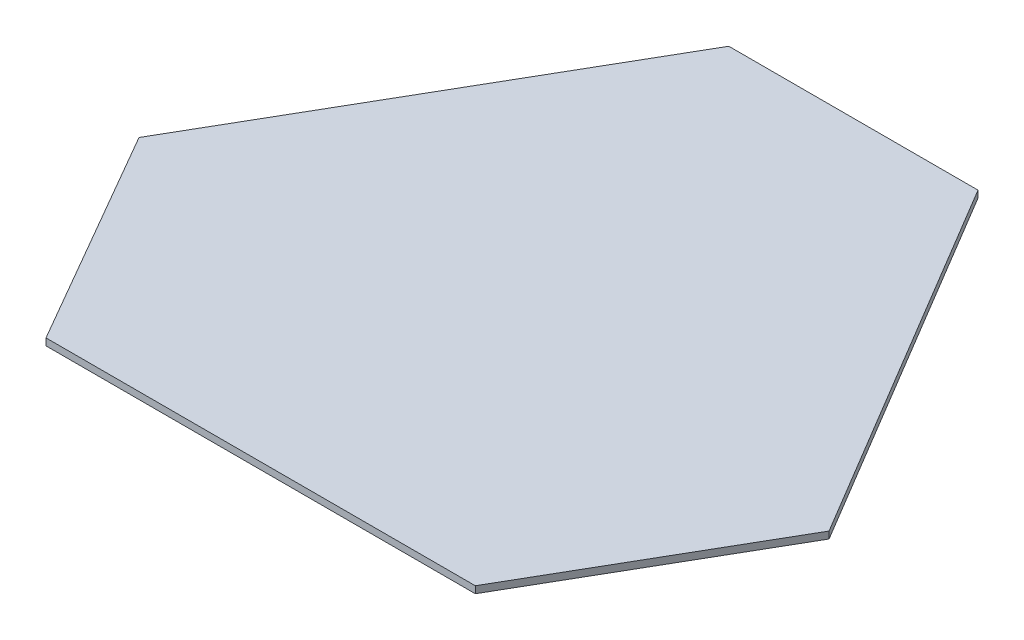
ISO-10303-21;
HEADER;
FILE_DESCRIPTION(('STEP AP214'),'2;1');
FILE_NAME('part.step','',(''),(''),'','','');
FILE_SCHEMA(('AUTOMOTIVE_DESIGN { 1 0 10303 214 1 1 1 1 }'));
ENDSEC;
DATA;
#1=APPLICATION_CONTEXT('core data for automotive mechanical design processes');
#2=APPLICATION_PROTOCOL_DEFINITION('international standard','automotive_design',2000,#1);
#3=PRODUCT_CONTEXT('',#1,'mechanical');
#4=PRODUCT('Part','Part','',(#3));
#5=PRODUCT_RELATED_PRODUCT_CATEGORY('part','',(#4));
#6=PRODUCT_DEFINITION_FORMATION('','',#4);
#7=PRODUCT_DEFINITION_CONTEXT('part definition',#1,'design');
#8=PRODUCT_DEFINITION('design','',#6,#7);
#9=PRODUCT_DEFINITION_SHAPE('','',#8);
#10=(LENGTH_UNIT() NAMED_UNIT(*) SI_UNIT(.MILLI.,.METRE.));
#11=(NAMED_UNIT(*) PLANE_ANGLE_UNIT() SI_UNIT($,.RADIAN.));
#12=(NAMED_UNIT(*) SI_UNIT($,.STERADIAN.) SOLID_ANGLE_UNIT());
#13=UNCERTAINTY_MEASURE_WITH_UNIT(LENGTH_MEASURE(1.E-05),#10,'distance_accuracy_value','');
#14=(GEOMETRIC_REPRESENTATION_CONTEXT(3) GLOBAL_UNCERTAINTY_ASSIGNED_CONTEXT((#13)) GLOBAL_UNIT_ASSIGNED_CONTEXT((#10,
#11,#12)) REPRESENTATION_CONTEXT('',''));
#15=CARTESIAN_POINT('',(0.,0.,0.));
#16=DIRECTION('',(0.,0.,1.));
#17=DIRECTION('',(1.,0.,0.));
#18=AXIS2_PLACEMENT_3D('',#15,#16,#17);
#19=CARTESIAN_POINT('',(-150.023446497774,3.,54.8587623398593));
#20=DIRECTION('',(0.866025403784419,0.,0.500000000000034));
#21=DIRECTION('',(0.500000000000034,0.,-0.866025403784419));
#22=AXIS2_PLACEMENT_3D('',#19,#20,#21);
#23=PLANE('',#22);
#24=DIRECTION('',(-0.500000000000034,0.,0.866025403784419));
#25=VECTOR('',#24,1.);
#26=CARTESIAN_POINT('',(-150.023446497774,0.,54.8587623398593));
#27=LINE('',#26,#25);
#28=CARTESIAN_POINT('',(-56.6816904909937,0.,-106.813901531567));
#29=VERTEX_POINT('',#28);
#30=CARTESIAN_POINT('',(-150.023446497774,0.,54.8587623398593));
#31=VERTEX_POINT('',#30);
#32=EDGE_CURVE('E121',#29,#31,#27,.T.);
#33=ORIENTED_EDGE('',*,*,#32,.T.);
#34=DIRECTION('',(0.,-1.,0.));
#35=VECTOR('',#34,1.);
#36=CARTESIAN_POINT('',(-150.023446497774,3.,54.8587623398593));
#37=LINE('',#36,#35);
#38=CARTESIAN_POINT('',(-150.023446497774,3.,54.8587623398593));
#39=VERTEX_POINT('',#38);
#40=EDGE_CURVE('E11',#39,#31,#37,.T.);
#41=ORIENTED_EDGE('',*,*,#40,.F.);
#42=DIRECTION('',(-0.500000000000034,0.,0.866025403784419));
#43=VECTOR('',#42,1.);
#44=CARTESIAN_POINT('',(-150.023446497774,3.,54.8587623398593));
#45=LINE('',#44,#43);
#46=CARTESIAN_POINT('',(-56.6816904909937,3.,-106.813901531567));
#47=VERTEX_POINT('',#46);
#48=EDGE_CURVE('E131',#47,#39,#45,.T.);
#49=ORIENTED_EDGE('',*,*,#48,.F.);
#50=DIRECTION('',(0.,-1.,0.));
#51=VECTOR('',#50,1.);
#52=CARTESIAN_POINT('',(-56.6816904909937,3.,-106.813901531567));
#53=LINE('',#52,#51);
#54=EDGE_CURVE('E117',#47,#29,#53,.T.);
#55=ORIENTED_EDGE('',*,*,#54,.T.);
#56=EDGE_LOOP('',(#33,#41,#49,#55));
#57=FACE_BOUND('',#56,.T.);
#58=ADVANCED_FACE('F37',(#57),#23,.F.);
#59=CARTESIAN_POINT('',(-150.023446497774,3.,54.8587623398593));
#60=DIRECTION('',(0.866025403784436,0.,-0.500000000000004));
#61=DIRECTION('',(-0.500000000000004,0.,-0.866025403784436));
#62=AXIS2_PLACEMENT_3D('',#59,#60,#61);
#63=PLANE('',#62);
#64=DIRECTION('',(0.500000000000004,0.,0.866025403784436));
#65=VECTOR('',#64,1.);
#66=CARTESIAN_POINT('',(-150.023446497774,0.,54.8587623398593));
#67=LINE('',#66,#65);
#68=CARTESIAN_POINT('',(-95.093627323657,0.,150.));
#69=VERTEX_POINT('',#68);
#70=EDGE_CURVE('E124',#31,#69,#67,.T.);
#71=ORIENTED_EDGE('',*,*,#70,.T.);
#72=DIRECTION('',(0.,-1.,0.));
#73=VECTOR('',#72,1.);
#74=CARTESIAN_POINT('',(-95.093627323657,3.,150.));
#75=LINE('',#74,#73);
#76=CARTESIAN_POINT('',(-95.093627323657,3.,150.));
#77=VERTEX_POINT('',#76);
#78=EDGE_CURVE('E45',#77,#69,#75,.T.);
#79=ORIENTED_EDGE('',*,*,#78,.F.);
#80=DIRECTION('',(0.500000000000004,0.,0.866025403784436));
#81=VECTOR('',#80,1.);
#82=CARTESIAN_POINT('',(-150.023446497774,3.,54.8587623398593));
#83=LINE('',#82,#81);
#84=EDGE_CURVE('E90',#39,#77,#83,.T.);
#85=ORIENTED_EDGE('',*,*,#84,.F.);
#86=ORIENTED_EDGE('',*,*,#40,.T.);
#87=EDGE_LOOP('',(#71,#79,#85,#86));
#88=FACE_BOUND('',#87,.T.);
#89=ADVANCED_FACE('F155',(#88),#63,.F.);
#90=CARTESIAN_POINT('',(90.5351716850649,3.,150.));
#91=DIRECTION('',(0.,0.,-1.));
#92=DIRECTION('',(-1.,0.,0.));
#93=AXIS2_PLACEMENT_3D('',#90,#91,#92);
#94=PLANE('',#93);
#95=DIRECTION('',(1.,0.,0.));
#96=VECTOR('',#95,1.);
#97=CARTESIAN_POINT('',(90.5351716850649,0.,150.));
#98=LINE('',#97,#96);
#99=CARTESIAN_POINT('',(90.5351716850649,0.,150.));
#100=VERTEX_POINT('',#99);
#101=EDGE_CURVE('E126',#69,#100,#98,.T.);
#102=ORIENTED_EDGE('',*,*,#101,.T.);
#103=DIRECTION('',(0.,-1.,0.));
#104=VECTOR('',#103,1.);
#105=CARTESIAN_POINT('',(90.5351716850649,3.,150.));
#106=LINE('',#105,#104);
#107=CARTESIAN_POINT('',(90.5351716850649,3.,150.));
#108=VERTEX_POINT('',#107);
#109=EDGE_CURVE('E112',#108,#100,#106,.T.);
#110=ORIENTED_EDGE('',*,*,#109,.F.);
#111=DIRECTION('',(1.,0.,0.));
#112=VECTOR('',#111,1.);
#113=CARTESIAN_POINT('',(90.5351716850649,3.,150.));
#114=LINE('',#113,#112);
#115=EDGE_CURVE('E103',#77,#108,#114,.T.);
#116=ORIENTED_EDGE('',*,*,#115,.F.);
#117=ORIENTED_EDGE('',*,*,#78,.T.);
#118=EDGE_LOOP('',(#102,#110,#116,#117));
#119=FACE_BOUND('',#118,.T.);
#120=ADVANCED_FACE('F137',(#119),#94,.F.);
#121=CARTESIAN_POINT('',(146.519703864001,3.,53.0319458281066));
#122=DIRECTION('',(-0.86602540378444,0.,-0.499999999999998));
#123=DIRECTION('',(-0.499999999999998,0.,0.86602540378444));
#124=AXIS2_PLACEMENT_3D('',#121,#122,#123);
#125=PLANE('',#124);
#126=DIRECTION('',(0.499999999999998,0.,-0.86602540378444));
#127=VECTOR('',#126,1.);
#128=CARTESIAN_POINT('',(146.519703864001,0.,53.0319458281066));
#129=LINE('',#128,#127);
#130=CARTESIAN_POINT('',(146.519703864001,0.,53.0319458281066));
#131=VERTEX_POINT('',#130);
#132=EDGE_CURVE('E111',#100,#131,#129,.T.);
#133=ORIENTED_EDGE('',*,*,#132,.T.);
#134=DIRECTION('',(0.,-1.,0.));
#135=VECTOR('',#134,1.);
#136=CARTESIAN_POINT('',(146.519703864001,3.,53.0319458281066));
#137=LINE('',#136,#135);
#138=CARTESIAN_POINT('',(146.519703864001,3.,53.0319458281066));
#139=VERTEX_POINT('',#138);
#140=EDGE_CURVE('E108',#139,#131,#137,.T.);
#141=ORIENTED_EDGE('',*,*,#140,.F.);
#142=DIRECTION('',(0.499999999999998,0.,-0.86602540378444));
#143=VECTOR('',#142,1.);
#144=CARTESIAN_POINT('',(146.519703864001,3.,53.0319458281066));
#145=LINE('',#144,#143);
#146=EDGE_CURVE('E97',#108,#139,#145,.T.);
#147=ORIENTED_EDGE('',*,*,#146,.F.);
#148=ORIENTED_EDGE('',*,*,#109,.T.);
#149=EDGE_LOOP('',(#133,#141,#147,#148));
#150=FACE_BOUND('',#149,.T.);
#151=ADVANCED_FACE('F109',(#150),#125,.F.);
#152=CARTESIAN_POINT('',(51.0685218475845,3.,-106.813901531567));
#153=DIRECTION('',(-0.858572374819057,0.,0.51269238067048));
#154=DIRECTION('',(0.51269238067048,0.,0.858572374819057));
#155=AXIS2_PLACEMENT_3D('',#152,#153,#154);
#156=PLANE('',#155);
#157=DIRECTION('',(-0.51269238067048,0.,-0.858572374819057));
#158=VECTOR('',#157,1.);
#159=CARTESIAN_POINT('',(51.0685218475845,0.,-106.813901531567));
#160=LINE('',#159,#158);
#161=CARTESIAN_POINT('',(51.0685218475845,0.,-106.813901531567));
#162=VERTEX_POINT('',#161);
#163=EDGE_CURVE('E76',#131,#162,#160,.T.);
#164=ORIENTED_EDGE('',*,*,#163,.T.);
#165=DIRECTION('',(0.,-1.,0.));
#166=VECTOR('',#165,1.);
#167=CARTESIAN_POINT('',(51.0685218475845,3.,-106.813901531567));
#168=LINE('',#167,#166);
#169=CARTESIAN_POINT('',(51.0685218475845,3.,-106.813901531567));
#170=VERTEX_POINT('',#169);
#171=EDGE_CURVE('E113',#170,#162,#168,.T.);
#172=ORIENTED_EDGE('',*,*,#171,.F.);
#173=DIRECTION('',(-0.51269238067048,0.,-0.858572374819057));
#174=VECTOR('',#173,1.);
#175=CARTESIAN_POINT('',(51.0685218475845,3.,-106.813901531567));
#176=LINE('',#175,#174);
#177=EDGE_CURVE('E101',#139,#170,#176,.T.);
#178=ORIENTED_EDGE('',*,*,#177,.F.);
#179=ORIENTED_EDGE('',*,*,#140,.T.);
#180=EDGE_LOOP('',(#164,#172,#178,#179));
#181=FACE_BOUND('',#180,.T.);
#182=ADVANCED_FACE('F115',(#181),#156,.F.);
#183=CARTESIAN_POINT('',(-56.6816904909937,3.,-106.813901531567));
#184=DIRECTION('',(0.,0.,1.));
#185=DIRECTION('',(1.,0.,0.));
#186=AXIS2_PLACEMENT_3D('',#183,#184,#185);
#187=PLANE('',#186);
#188=DIRECTION('',(-1.,0.,0.));
#189=VECTOR('',#188,1.);
#190=CARTESIAN_POINT('',(-56.6816904909937,0.,-106.813901531567));
#191=LINE('',#190,#189);
#192=EDGE_CURVE('E82',#162,#29,#191,.T.);
#193=ORIENTED_EDGE('',*,*,#192,.T.);
#194=ORIENTED_EDGE('',*,*,#54,.F.);
#195=DIRECTION('',(-1.,0.,0.));
#196=VECTOR('',#195,1.);
#197=CARTESIAN_POINT('',(-56.6816904909937,3.,-106.813901531567));
#198=LINE('',#197,#196);
#199=EDGE_CURVE('E53',#170,#47,#198,.T.);
#200=ORIENTED_EDGE('',*,*,#199,.F.);
#201=ORIENTED_EDGE('',*,*,#171,.T.);
#202=EDGE_LOOP('',(#193,#194,#200,#201));
#203=FACE_BOUND('',#202,.T.);
#204=ADVANCED_FACE('F144',(#203),#187,.F.);
#205=CARTESIAN_POINT('',(0.,3.,0.));
#206=DIRECTION('',(0.,-1.,0.));
#207=DIRECTION('',(0.,0.,-1.));
#208=AXIS2_PLACEMENT_3D('',#205,#206,#207);
#209=PLANE('',#208);
#210=ORIENTED_EDGE('',*,*,#48,.T.);
#211=ORIENTED_EDGE('',*,*,#84,.T.);
#212=ORIENTED_EDGE('',*,*,#115,.T.);
#213=ORIENTED_EDGE('',*,*,#146,.T.);
#214=ORIENTED_EDGE('',*,*,#177,.T.);
#215=ORIENTED_EDGE('',*,*,#199,.T.);
#216=EDGE_LOOP('',(#210,#211,#212,#213,#214,#215));
#217=FACE_BOUND('',#216,.T.);
#218=ADVANCED_FACE('F99',(#217),#209,.F.);
#219=CARTESIAN_POINT('',(0.,0.,0.));
#220=DIRECTION('',(0.,-1.,0.));
#221=DIRECTION('',(0.,0.,-1.));
#222=AXIS2_PLACEMENT_3D('',#219,#220,#221);
#223=PLANE('',#222);
#224=ORIENTED_EDGE('',*,*,#32,.F.);
#225=ORIENTED_EDGE('',*,*,#192,.F.);
#226=ORIENTED_EDGE('',*,*,#163,.F.);
#227=ORIENTED_EDGE('',*,*,#132,.F.);
#228=ORIENTED_EDGE('',*,*,#101,.F.);
#229=ORIENTED_EDGE('',*,*,#70,.F.);
#230=EDGE_LOOP('',(#224,#225,#226,#227,#228,#229));
#231=FACE_BOUND('',#230,.T.);
#232=ADVANCED_FACE('F140',(#231),#223,.T.);
#233=CLOSED_SHELL('',(#58,#89,#120,#151,#182,#204,#218,#232));
#234=MANIFOLD_SOLID_BREP('B2',#233);
#235=ADVANCED_BREP_SHAPE_REPRESENTATION('',(#18,#234),#14);
#236=SHAPE_DEFINITION_REPRESENTATION(#9,#235);
ENDSEC;
END-ISO-10303-21;
